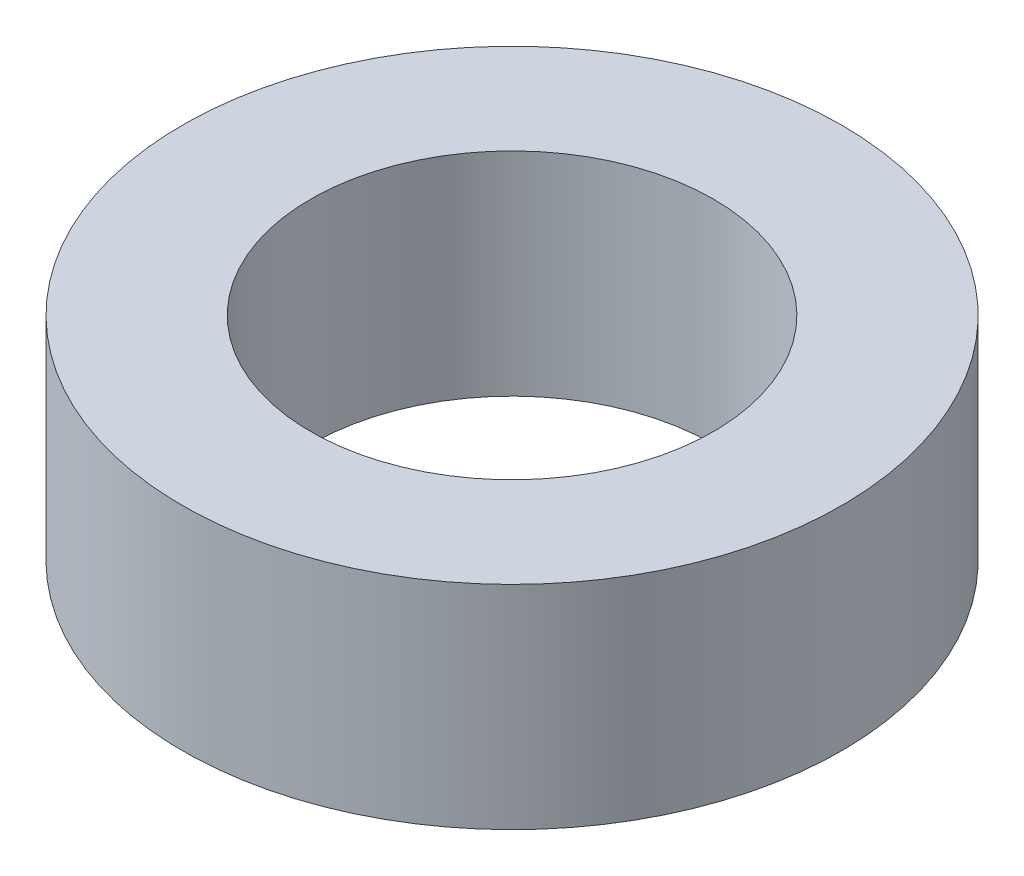
ISO-10303-21;
HEADER;
FILE_DESCRIPTION(('STEP AP214'),'2;1');
FILE_NAME('part.step','',(''),(''),'','','');
FILE_SCHEMA(('AUTOMOTIVE_DESIGN { 1 0 10303 214 1 1 1 1 }'));
ENDSEC;
DATA;
#1=APPLICATION_CONTEXT('core data for automotive mechanical design processes');
#2=APPLICATION_PROTOCOL_DEFINITION('international standard','automotive_design',2000,#1);
#3=PRODUCT_CONTEXT('',#1,'mechanical');
#4=PRODUCT('Part','Part','',(#3));
#5=PRODUCT_RELATED_PRODUCT_CATEGORY('part','',(#4));
#6=PRODUCT_DEFINITION_FORMATION('','',#4);
#7=PRODUCT_DEFINITION_CONTEXT('part definition',#1,'design');
#8=PRODUCT_DEFINITION('design','',#6,#7);
#9=PRODUCT_DEFINITION_SHAPE('','',#8);
#10=(LENGTH_UNIT() NAMED_UNIT(*) SI_UNIT(.MILLI.,.METRE.));
#11=(NAMED_UNIT(*) PLANE_ANGLE_UNIT() SI_UNIT($,.RADIAN.));
#12=(NAMED_UNIT(*) SI_UNIT($,.STERADIAN.) SOLID_ANGLE_UNIT());
#13=UNCERTAINTY_MEASURE_WITH_UNIT(LENGTH_MEASURE(1.E-05),#10,'distance_accuracy_value','');
#14=(GEOMETRIC_REPRESENTATION_CONTEXT(3) GLOBAL_UNCERTAINTY_ASSIGNED_CONTEXT((#13)) GLOBAL_UNIT_ASSIGNED_CONTEXT((#10,
#11,#12)) REPRESENTATION_CONTEXT('',''));
#15=CARTESIAN_POINT('',(0.,0.,0.));
#16=DIRECTION('',(0.,0.,1.));
#17=DIRECTION('',(1.,0.,0.));
#18=AXIS2_PLACEMENT_3D('',#15,#16,#17);
#19=CARTESIAN_POINT('',(0.,29.,0.));
#20=DIRECTION('',(0.,-1.,0.));
#21=DIRECTION('',(0.,0.,-1.));
#22=AXIS2_PLACEMENT_3D('',#19,#20,#21);
#23=CYLINDRICAL_SURFACE('',#22,45.);
#24=CARTESIAN_POINT('',(0.,29.,0.));
#25=DIRECTION('',(0.,1.,0.));
#26=DIRECTION('',(0.,0.,1.));
#27=AXIS2_PLACEMENT_3D('',#24,#25,#26);
#28=CIRCLE('',#27,45.);
#29=CARTESIAN_POINT('',(0.,29.,-45.));
#30=VERTEX_POINT('',#29);
#31=EDGE_CURVE('E10',#30,#30,#28,.T.);
#32=CARTESIAN_POINT('',(0.,0.,0.));
#33=DIRECTION('',(0.,1.,0.));
#34=DIRECTION('',(0.,0.,1.));
#35=AXIS2_PLACEMENT_3D('',#32,#33,#34);
#36=CIRCLE('',#35,45.);
#37=CARTESIAN_POINT('',(0.,0.,-45.));
#38=VERTEX_POINT('',#37);
#39=EDGE_CURVE('E37',#38,#38,#36,.T.);
#40=CARTESIAN_POINT('',(0.,29.,-45.));
#41=CARTESIAN_POINT('',(0.,28.6979166666667,-45.));
#42=CARTESIAN_POINT('',(0.,28.3958333333333,-45.));
#43=CARTESIAN_POINT('',(0.,27.7916666666667,-45.));
#44=CARTESIAN_POINT('',(0.,27.4895833333333,-45.));
#45=CARTESIAN_POINT('',(0.,26.8854166666667,-45.));
#46=CARTESIAN_POINT('',(0.,26.5833333333333,-45.));
#47=CARTESIAN_POINT('',(0.,25.9791666666667,-45.));
#48=CARTESIAN_POINT('',(0.,25.6770833333333,-45.));
#49=CARTESIAN_POINT('',(0.,25.0729166666667,-45.));
#50=CARTESIAN_POINT('',(0.,24.7708333333333,-45.));
#51=CARTESIAN_POINT('',(0.,24.1666666666667,-45.));
#52=CARTESIAN_POINT('',(0.,23.8645833333333,-45.));
#53=CARTESIAN_POINT('',(0.,23.2604166666667,-45.));
#54=CARTESIAN_POINT('',(0.,22.9583333333333,-45.));
#55=CARTESIAN_POINT('',(0.,22.3541666666667,-45.));
#56=CARTESIAN_POINT('',(0.,22.0520833333333,-45.));
#57=CARTESIAN_POINT('',(0.,21.4479166666667,-45.));
#58=CARTESIAN_POINT('',(0.,21.1458333333333,-45.));
#59=CARTESIAN_POINT('',(0.,20.5416666666667,-45.));
#60=CARTESIAN_POINT('',(0.,20.2395833333333,-45.));
#61=CARTESIAN_POINT('',(0.,19.6354166666667,-45.));
#62=CARTESIAN_POINT('',(0.,19.3333333333333,-45.));
#63=CARTESIAN_POINT('',(0.,18.7291666666667,-45.));
#64=CARTESIAN_POINT('',(0.,18.4270833333333,-45.));
#65=CARTESIAN_POINT('',(0.,17.8229166666667,-45.));
#66=CARTESIAN_POINT('',(0.,17.5208333333333,-45.));
#67=CARTESIAN_POINT('',(0.,16.9166666666667,-45.));
#68=CARTESIAN_POINT('',(0.,16.6145833333333,-45.));
#69=CARTESIAN_POINT('',(0.,16.0104166666667,-45.));
#70=CARTESIAN_POINT('',(0.,15.7083333333333,-45.));
#71=CARTESIAN_POINT('',(0.,15.1041666666667,-45.));
#72=CARTESIAN_POINT('',(0.,14.8020833333333,-45.));
#73=CARTESIAN_POINT('',(0.,14.1979166666667,-45.));
#74=CARTESIAN_POINT('',(0.,13.8958333333333,-45.));
#75=CARTESIAN_POINT('',(0.,13.2916666666667,-45.));
#76=CARTESIAN_POINT('',(0.,12.9895833333333,-45.));
#77=CARTESIAN_POINT('',(0.,12.3854166666667,-45.));
#78=CARTESIAN_POINT('',(0.,12.0833333333333,-45.));
#79=CARTESIAN_POINT('',(0.,11.4791666666667,-45.));
#80=CARTESIAN_POINT('',(0.,11.1770833333333,-45.));
#81=CARTESIAN_POINT('',(0.,10.5729166666667,-45.));
#82=CARTESIAN_POINT('',(0.,10.2708333333333,-45.));
#83=CARTESIAN_POINT('',(0.,9.66666666666667,-45.));
#84=CARTESIAN_POINT('',(0.,9.36458333333333,-45.));
#85=CARTESIAN_POINT('',(0.,8.76041666666667,-45.));
#86=CARTESIAN_POINT('',(0.,8.45833333333333,-45.));
#87=CARTESIAN_POINT('',(0.,7.85416666666667,-45.));
#88=CARTESIAN_POINT('',(0.,7.55208333333333,-45.));
#89=CARTESIAN_POINT('',(0.,6.94791666666667,-45.));
#90=CARTESIAN_POINT('',(0.,6.64583333333333,-45.));
#91=CARTESIAN_POINT('',(0.,6.04166666666667,-45.));
#92=CARTESIAN_POINT('',(0.,5.73958333333333,-45.));
#93=CARTESIAN_POINT('',(0.,5.13541666666667,-45.));
#94=CARTESIAN_POINT('',(0.,4.83333333333333,-45.));
#95=CARTESIAN_POINT('',(0.,4.22916666666667,-45.));
#96=CARTESIAN_POINT('',(0.,3.92708333333333,-45.));
#97=CARTESIAN_POINT('',(0.,3.32291666666667,-45.));
#98=CARTESIAN_POINT('',(0.,3.02083333333333,-45.));
#99=CARTESIAN_POINT('',(0.,2.41666666666667,-45.));
#100=CARTESIAN_POINT('',(0.,2.11458333333333,-45.));
#101=CARTESIAN_POINT('',(0.,1.51041666666667,-45.));
#102=CARTESIAN_POINT('',(0.,1.20833333333333,-45.));
#103=CARTESIAN_POINT('',(0.,0.604166666666667,-45.));
#104=CARTESIAN_POINT('',(0.,0.302083333333333,-45.));
#105=CARTESIAN_POINT('',(0.,0.,-45.));
#106=B_SPLINE_CURVE_WITH_KNOTS('',3,(#40,#41,#42,#43,#44,#45,#46,#47,#48,#49,#50,#51,#52,#53,
#54,#55,#56,#57,#58,#59,#60,#61,#62,#63,#64,#65,#66,#67,#68,#69,#70,#71,#72,#73,#74,#75,#76,#77,
#78,#79,#80,#81,#82,#83,#84,#85,#86,#87,#88,#89,#90,#91,#92,#93,#94,#95,#96,#97,#98,#99,#100,
#101,#102,#103,#104,#105),.UNSPECIFIED.,.F.,.F.,(4,2,2,2,2,2,2,2,2,2,2,2,2,2,2,2,2,2,2,2,2,2,2,
2,2,2,2,2,2,2,2,2,4),(0.,0.906249999999997,1.8125,2.71875,3.625,4.53125,5.4375,6.34375,7.25,
8.15625,9.0625,9.96875,10.875,11.78125,12.6875,13.59375,14.5,15.40625,16.3125,17.21875,18.125,
19.03125,19.9375,20.84375,21.75,22.65625,23.5625,24.46875,25.375,26.28125,27.1875,28.09375,29.),.UNSPECIFIED.);
#107=EDGE_CURVE('BSEAM40',#30,#38,#106,.T.);
#108=ORIENTED_EDGE('',*,*,#31,.F.);
#109=ORIENTED_EDGE('',*,*,#39,.T.);
#110=ORIENTED_EDGE('',*,*,#107,.T.);
#111=ORIENTED_EDGE('',*,*,#107,.F.);
#112=EDGE_LOOP('',(#108,#110,#109,#111));
#113=FACE_BOUND('',#112,.T.);
#114=ADVANCED_FACE('F40',(#113),#23,.T.);
#115=CARTESIAN_POINT('',(0.,29.,0.));
#116=DIRECTION('',(0.,1.,0.));
#117=DIRECTION('',(0.,0.,1.));
#118=AXIS2_PLACEMENT_3D('',#115,#116,#117);
#119=PLANE('',#118);
#120=CARTESIAN_POINT('',(0.,29.,0.));
#121=DIRECTION('',(0.,1.,0.));
#122=DIRECTION('',(0.,0.,1.));
#123=AXIS2_PLACEMENT_3D('',#120,#121,#122);
#124=CIRCLE('',#123,27.5);
#125=CARTESIAN_POINT('',(0.,29.,-27.5));
#126=VERTEX_POINT('',#125);
#127=EDGE_CURVE('E50',#126,#126,#124,.T.);
#128=ORIENTED_EDGE('',*,*,#127,.F.);
#129=EDGE_LOOP('',(#128));
#130=FACE_BOUND('',#129,.T.);
#131=ORIENTED_EDGE('',*,*,#31,.T.);
#132=EDGE_LOOP('',(#131));
#133=FACE_BOUND('',#132,.T.);
#134=ADVANCED_FACE('F59',(#130,#133),#119,.T.);
#135=CARTESIAN_POINT('',(0.,0.,0.));
#136=DIRECTION('',(0.,1.,0.));
#137=DIRECTION('',(0.,0.,1.));
#138=AXIS2_PLACEMENT_3D('',#135,#136,#137);
#139=PLANE('',#138);
#140=CARTESIAN_POINT('',(0.,0.,0.));
#141=DIRECTION('',(0.,1.,0.));
#142=DIRECTION('',(0.,0.,1.));
#143=AXIS2_PLACEMENT_3D('',#140,#141,#142);
#144=CIRCLE('',#143,27.5);
#145=CARTESIAN_POINT('',(0.,0.,-27.5));
#146=VERTEX_POINT('',#145);
#147=EDGE_CURVE('E47',#146,#146,#144,.T.);
#148=ORIENTED_EDGE('',*,*,#147,.T.);
#149=EDGE_LOOP('',(#148));
#150=FACE_BOUND('',#149,.T.);
#151=ORIENTED_EDGE('',*,*,#39,.F.);
#152=EDGE_LOOP('',(#151));
#153=FACE_BOUND('',#152,.T.);
#154=ADVANCED_FACE('F58',(#150,#153),#139,.F.);
#155=CARTESIAN_POINT('',(0.,29.,0.));
#156=DIRECTION('',(0.,-1.,0.));
#157=DIRECTION('',(0.,0.,-1.));
#158=AXIS2_PLACEMENT_3D('',#155,#156,#157);
#159=CYLINDRICAL_SURFACE('',#158,27.5);
#160=CARTESIAN_POINT('',(0.,29.,-27.5));
#161=CARTESIAN_POINT('',(0.,28.6979166666667,-27.5));
#162=CARTESIAN_POINT('',(0.,28.3958333333333,-27.5));
#163=CARTESIAN_POINT('',(0.,27.7916666666667,-27.5));
#164=CARTESIAN_POINT('',(0.,27.4895833333333,-27.5));
#165=CARTESIAN_POINT('',(0.,26.8854166666667,-27.5));
#166=CARTESIAN_POINT('',(0.,26.5833333333333,-27.5));
#167=CARTESIAN_POINT('',(0.,25.9791666666667,-27.5));
#168=CARTESIAN_POINT('',(0.,25.6770833333333,-27.5));
#169=CARTESIAN_POINT('',(0.,25.0729166666667,-27.5));
#170=CARTESIAN_POINT('',(0.,24.7708333333333,-27.5));
#171=CARTESIAN_POINT('',(0.,24.1666666666667,-27.5));
#172=CARTESIAN_POINT('',(0.,23.8645833333333,-27.5));
#173=CARTESIAN_POINT('',(0.,23.2604166666667,-27.5));
#174=CARTESIAN_POINT('',(0.,22.9583333333333,-27.5));
#175=CARTESIAN_POINT('',(0.,22.3541666666667,-27.5));
#176=CARTESIAN_POINT('',(0.,22.0520833333333,-27.5));
#177=CARTESIAN_POINT('',(0.,21.4479166666667,-27.5));
#178=CARTESIAN_POINT('',(0.,21.1458333333333,-27.5));
#179=CARTESIAN_POINT('',(0.,20.5416666666667,-27.5));
#180=CARTESIAN_POINT('',(0.,20.2395833333333,-27.5));
#181=CARTESIAN_POINT('',(0.,19.6354166666667,-27.5));
#182=CARTESIAN_POINT('',(0.,19.3333333333333,-27.5));
#183=CARTESIAN_POINT('',(0.,18.7291666666667,-27.5));
#184=CARTESIAN_POINT('',(0.,18.4270833333333,-27.5));
#185=CARTESIAN_POINT('',(0.,17.8229166666667,-27.5));
#186=CARTESIAN_POINT('',(0.,17.5208333333333,-27.5));
#187=CARTESIAN_POINT('',(0.,16.9166666666667,-27.5));
#188=CARTESIAN_POINT('',(0.,16.6145833333333,-27.5));
#189=CARTESIAN_POINT('',(0.,16.0104166666667,-27.5));
#190=CARTESIAN_POINT('',(0.,15.7083333333333,-27.5));
#191=CARTESIAN_POINT('',(0.,15.1041666666667,-27.5));
#192=CARTESIAN_POINT('',(0.,14.8020833333333,-27.5));
#193=CARTESIAN_POINT('',(0.,14.1979166666667,-27.5));
#194=CARTESIAN_POINT('',(0.,13.8958333333333,-27.5));
#195=CARTESIAN_POINT('',(0.,13.2916666666667,-27.5));
#196=CARTESIAN_POINT('',(0.,12.9895833333333,-27.5));
#197=CARTESIAN_POINT('',(0.,12.3854166666667,-27.5));
#198=CARTESIAN_POINT('',(0.,12.0833333333333,-27.5));
#199=CARTESIAN_POINT('',(0.,11.4791666666667,-27.5));
#200=CARTESIAN_POINT('',(0.,11.1770833333333,-27.5));
#201=CARTESIAN_POINT('',(0.,10.5729166666667,-27.5));
#202=CARTESIAN_POINT('',(0.,10.2708333333333,-27.5));
#203=CARTESIAN_POINT('',(0.,9.66666666666667,-27.5));
#204=CARTESIAN_POINT('',(0.,9.36458333333333,-27.5));
#205=CARTESIAN_POINT('',(0.,8.76041666666667,-27.5));
#206=CARTESIAN_POINT('',(0.,8.45833333333333,-27.5));
#207=CARTESIAN_POINT('',(0.,7.85416666666667,-27.5));
#208=CARTESIAN_POINT('',(0.,7.55208333333333,-27.5));
#209=CARTESIAN_POINT('',(0.,6.94791666666667,-27.5));
#210=CARTESIAN_POINT('',(0.,6.64583333333333,-27.5));
#211=CARTESIAN_POINT('',(0.,6.04166666666667,-27.5));
#212=CARTESIAN_POINT('',(0.,5.73958333333333,-27.5));
#213=CARTESIAN_POINT('',(0.,5.13541666666667,-27.5));
#214=CARTESIAN_POINT('',(0.,4.83333333333333,-27.5));
#215=CARTESIAN_POINT('',(0.,4.22916666666667,-27.5));
#216=CARTESIAN_POINT('',(0.,3.92708333333333,-27.5));
#217=CARTESIAN_POINT('',(0.,3.32291666666667,-27.5));
#218=CARTESIAN_POINT('',(0.,3.02083333333333,-27.5));
#219=CARTESIAN_POINT('',(0.,2.41666666666667,-27.5));
#220=CARTESIAN_POINT('',(0.,2.11458333333333,-27.5));
#221=CARTESIAN_POINT('',(0.,1.51041666666667,-27.5));
#222=CARTESIAN_POINT('',(0.,1.20833333333333,-27.5));
#223=CARTESIAN_POINT('',(0.,0.604166666666667,-27.5));
#224=CARTESIAN_POINT('',(0.,0.302083333333333,-27.5));
#225=CARTESIAN_POINT('',(0.,0.,-27.5));
#226=B_SPLINE_CURVE_WITH_KNOTS('',3,(#160,#161,#162,#163,#164,#165,#166,#167,#168,#169,#170,
#171,#172,#173,#174,#175,#176,#177,#178,#179,#180,#181,#182,#183,#184,#185,#186,#187,#188,#189,
#190,#191,#192,#193,#194,#195,#196,#197,#198,#199,#200,#201,#202,#203,#204,#205,#206,#207,#208,
#209,#210,#211,#212,#213,#214,#215,#216,#217,#218,#219,#220,#221,#222,#223,#224,#225),
.UNSPECIFIED.,.F.,.F.,(4,2,2,2,2,2,2,2,2,2,2,2,2,2,2,2,2,2,2,2,2,2,2,2,2,2,2,2,2,2,2,2,4),(0.,
0.906249999999997,1.8125,2.71875,3.625,4.53125,5.4375,6.34375,7.25,8.15625,9.0625,9.96875,
10.875,11.78125,12.6875,13.59375,14.5,15.40625,16.3125,17.21875,18.125,19.03125,19.9375,
20.84375,21.75,22.65625,23.5625,24.46875,25.375,26.28125,27.1875,28.09375,29.),.UNSPECIFIED.);
#227=EDGE_CURVE('BSEAM54',#126,#146,#226,.T.);
#228=ORIENTED_EDGE('',*,*,#127,.T.);
#229=ORIENTED_EDGE('',*,*,#147,.F.);
#230=ORIENTED_EDGE('',*,*,#227,.T.);
#231=ORIENTED_EDGE('',*,*,#227,.F.);
#232=EDGE_LOOP('',(#228,#230,#229,#231));
#233=FACE_BOUND('',#232,.T.);
#234=ADVANCED_FACE('F54',(#233),#159,.F.);
#235=CLOSED_SHELL('',(#114,#134,#154,#234));
#236=MANIFOLD_SOLID_BREP('B2',#235);
#237=ADVANCED_BREP_SHAPE_REPRESENTATION('',(#18,#236),#14);
#238=SHAPE_DEFINITION_REPRESENTATION(#9,#237);
ENDSEC;
END-ISO-10303-21;
